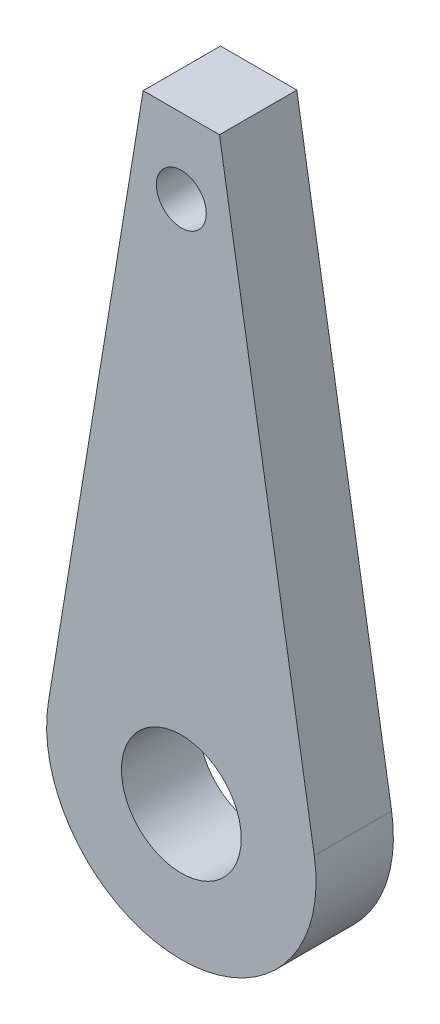
ISO-10303-21;
HEADER;
FILE_DESCRIPTION(('STEP AP214'),'2;1');
FILE_NAME('part.step','',(''),(''),'','','');
FILE_SCHEMA(('AUTOMOTIVE_DESIGN { 1 0 10303 214 1 1 1 1 }'));
ENDSEC;
DATA;
#1=APPLICATION_CONTEXT('core data for automotive mechanical design processes');
#2=APPLICATION_PROTOCOL_DEFINITION('international standard','automotive_design',2000,#1);
#3=PRODUCT_CONTEXT('',#1,'mechanical');
#4=PRODUCT('Part','Part','',(#3));
#5=PRODUCT_RELATED_PRODUCT_CATEGORY('part','',(#4));
#6=PRODUCT_DEFINITION_FORMATION('','',#4);
#7=PRODUCT_DEFINITION_CONTEXT('part definition',#1,'design');
#8=PRODUCT_DEFINITION('design','',#6,#7);
#9=PRODUCT_DEFINITION_SHAPE('','',#8);
#10=(LENGTH_UNIT() NAMED_UNIT(*) SI_UNIT(.MILLI.,.METRE.));
#11=(NAMED_UNIT(*) PLANE_ANGLE_UNIT() SI_UNIT($,.RADIAN.));
#12=(NAMED_UNIT(*) SI_UNIT($,.STERADIAN.) SOLID_ANGLE_UNIT());
#13=UNCERTAINTY_MEASURE_WITH_UNIT(LENGTH_MEASURE(1.E-05),#10,'distance_accuracy_value','');
#14=(GEOMETRIC_REPRESENTATION_CONTEXT(3) GLOBAL_UNCERTAINTY_ASSIGNED_CONTEXT((#13)) GLOBAL_UNIT_ASSIGNED_CONTEXT((#10,
#11,#12)) REPRESENTATION_CONTEXT('',''));
#15=CARTESIAN_POINT('',(0.,0.,0.));
#16=DIRECTION('',(0.,0.,1.));
#17=DIRECTION('',(1.,0.,0.));
#18=AXIS2_PLACEMENT_3D('',#15,#16,#17);
#19=CARTESIAN_POINT('',(-7.36509490352156,-1.20995375006958,3.1));
#20=DIRECTION('',(-0.986772828097113,-0.162109178423755,0.));
#21=DIRECTION('',(0.162109178423755,-0.986772828097113,0.));
#22=AXIS2_PLACEMENT_3D('',#19,#20,#21);
#23=PLANE('',#22);
#24=DIRECTION('',(-0.162109178423755,0.986772828097113,0.));
#25=VECTOR('',#24,1.);
#26=CARTESIAN_POINT('',(-7.36509490352156,-1.20995375006958,0.));
#27=LINE('',#26,#25);
#28=CARTESIAN_POINT('',(-13.7238132981727,37.4961244274482,0.));
#29=VERTEX_POINT('',#28);
#30=CARTESIAN_POINT('',(-17.5227744090712,60.6207348639599,0.));
#31=VERTEX_POINT('',#30);
#32=EDGE_CURVE('E118',#29,#31,#27,.T.);
#33=ORIENTED_EDGE('',*,*,#32,.T.);
#34=DIRECTION('',(0.,0.,-1.));
#35=VECTOR('',#34,1.);
#36=CARTESIAN_POINT('',(-17.5227744090712,60.6207348639599,3.1));
#37=LINE('',#36,#35);
#38=CARTESIAN_POINT('',(-17.5227744090712,60.6207348639599,3.1));
#39=VERTEX_POINT('',#38);
#40=EDGE_CURVE('E13',#39,#31,#37,.T.);
#41=ORIENTED_EDGE('',*,*,#40,.F.);
#42=DIRECTION('',(-0.162109178423755,0.986772828097113,0.));
#43=VECTOR('',#42,1.);
#44=CARTESIAN_POINT('',(-7.36509490352156,-1.20995375006958,3.1));
#45=LINE('',#44,#43);
#46=CARTESIAN_POINT('',(-13.7238132981727,37.4961244274482,3.1));
#47=VERTEX_POINT('',#46);
#48=EDGE_CURVE('E88',#47,#39,#45,.T.);
#49=ORIENTED_EDGE('',*,*,#48,.F.);
#50=DIRECTION('',(0.,0.,-1.));
#51=VECTOR('',#50,1.);
#52=CARTESIAN_POINT('',(-13.7238132981727,37.4961244274482,3.1));
#53=LINE('',#52,#51);
#54=EDGE_CURVE('E114',#47,#29,#53,.T.);
#55=ORIENTED_EDGE('',*,*,#54,.T.);
#56=EDGE_LOOP('',(#33,#41,#49,#55));
#57=FACE_BOUND('',#56,.T.);
#58=ADVANCED_FACE('F48',(#57),#23,.F.);
#59=CARTESIAN_POINT('',(0.,60.6207348639599,3.1));
#60=DIRECTION('',(0.,1.,0.));
#61=DIRECTION('',(0.,0.,1.));
#62=AXIS2_PLACEMENT_3D('',#59,#60,#61);
#63=PLANE('',#62);
#64=DIRECTION('',(1.,0.,0.));
#65=VECTOR('',#64,1.);
#66=CARTESIAN_POINT('',(0.,60.6207348639599,0.));
#67=LINE('',#66,#65);
#68=CARTESIAN_POINT('',(-20.581998730723,60.6207348639599,0.));
#69=VERTEX_POINT('',#68);
#70=EDGE_CURVE('E97',#69,#31,#67,.T.);
#71=ORIENTED_EDGE('',*,*,#70,.F.);
#72=DIRECTION('',(0.,0.,-1.));
#73=VECTOR('',#72,1.);
#74=CARTESIAN_POINT('',(-20.581998730723,60.6207348639599,3.1));
#75=LINE('',#74,#73);
#76=CARTESIAN_POINT('',(-20.581998730723,60.6207348639599,3.1));
#77=VERTEX_POINT('',#76);
#78=EDGE_CURVE('E57',#77,#69,#75,.T.);
#79=ORIENTED_EDGE('',*,*,#78,.F.);
#80=DIRECTION('',(1.,0.,0.));
#81=VECTOR('',#80,1.);
#82=CARTESIAN_POINT('',(0.,60.6207348639599,3.1));
#83=LINE('',#82,#81);
#84=EDGE_CURVE('E95',#77,#39,#83,.T.);
#85=ORIENTED_EDGE('',*,*,#84,.T.);
#86=ORIENTED_EDGE('',*,*,#40,.T.);
#87=EDGE_LOOP('',(#71,#79,#85,#86));
#88=FACE_BOUND('',#87,.T.);
#89=ADVANCED_FACE('F94',(#88),#63,.T.);
#90=CARTESIAN_POINT('',(-29.7383082048074,4.88547371140148,3.1));
#91=DIRECTION('',(-0.986772828097113,0.162109178423755,0.));
#92=DIRECTION('',(-0.162109178423755,-0.986772828097113,0.));
#93=AXIS2_PLACEMENT_3D('',#90,#91,#92);
#94=PLANE('',#93);
#95=DIRECTION('',(0.162109178423755,0.986772828097113,0.));
#96=VECTOR('',#95,1.);
#97=CARTESIAN_POINT('',(-29.7383082048074,4.88547371140148,0.));
#98=LINE('',#97,#96);
#99=CARTESIAN_POINT('',(-24.3809598416215,37.4961244274482,0.));
#100=VERTEX_POINT('',#99);
#101=EDGE_CURVE('E122',#100,#69,#98,.T.);
#102=ORIENTED_EDGE('',*,*,#101,.F.);
#103=DIRECTION('',(0.,0.,-1.));
#104=VECTOR('',#103,1.);
#105=CARTESIAN_POINT('',(-24.3809598416215,37.4961244274482,3.1));
#106=LINE('',#105,#104);
#107=CARTESIAN_POINT('',(-24.3809598416215,37.4961244274482,3.1));
#108=VERTEX_POINT('',#107);
#109=EDGE_CURVE('E80',#108,#100,#106,.T.);
#110=ORIENTED_EDGE('',*,*,#109,.F.);
#111=DIRECTION('',(0.162109178423755,0.986772828097113,0.));
#112=VECTOR('',#111,1.);
#113=CARTESIAN_POINT('',(-29.7383082048074,4.88547371140148,3.1));
#114=LINE('',#113,#112);
#115=EDGE_CURVE('E104',#108,#77,#114,.T.);
#116=ORIENTED_EDGE('',*,*,#115,.T.);
#117=ORIENTED_EDGE('',*,*,#78,.T.);
#118=EDGE_LOOP('',(#102,#110,#116,#117));
#119=FACE_BOUND('',#118,.T.);
#120=ADVANCED_FACE('F106',(#119),#94,.T.);
#121=CARTESIAN_POINT('',(-19.0523865698971,36.6207348639599,3.1));
#122=DIRECTION('',(0.,0.,-1.));
#123=DIRECTION('',(-1.,0.,0.));
#124=AXIS2_PLACEMENT_3D('',#121,#122,#123);
#125=CYLINDRICAL_SURFACE('',#124,5.4);
#126=CARTESIAN_POINT('',(-19.0523865698971,36.6207348639599,0.));
#127=DIRECTION('',(0.,0.,1.));
#128=DIRECTION('',(1.,0.,0.));
#129=AXIS2_PLACEMENT_3D('',#126,#127,#128);
#130=CIRCLE('',#129,5.4);
#131=EDGE_CURVE('E83',#100,#29,#130,.T.);
#132=ORIENTED_EDGE('',*,*,#131,.T.);
#133=ORIENTED_EDGE('',*,*,#54,.F.);
#134=CARTESIAN_POINT('',(-19.0523865698971,36.6207348639599,3.1));
#135=DIRECTION('',(0.,0.,1.));
#136=DIRECTION('',(1.,0.,0.));
#137=AXIS2_PLACEMENT_3D('',#134,#135,#136);
#138=CIRCLE('',#137,5.4);
#139=EDGE_CURVE('E65',#108,#47,#138,.T.);
#140=ORIENTED_EDGE('',*,*,#139,.F.);
#141=ORIENTED_EDGE('',*,*,#109,.T.);
#142=EDGE_LOOP('',(#132,#133,#140,#141));
#143=FACE_BOUND('',#142,.T.);
#144=ADVANCED_FACE('F150',(#143),#125,.T.);
#145=CARTESIAN_POINT('',(-19.0523865698971,57.6207348639599,3.1));
#146=DIRECTION('',(0.,0.,-1.));
#147=DIRECTION('',(-1.,0.,0.));
#148=AXIS2_PLACEMENT_3D('',#145,#146,#147);
#149=CYLINDRICAL_SURFACE('',#148,1.);
#150=CARTESIAN_POINT('',(-19.0523865698971,57.6207348639599,3.1));
#151=DIRECTION('',(0.,0.,1.));
#152=DIRECTION('',(1.,0.,0.));
#153=AXIS2_PLACEMENT_3D('',#150,#151,#152);
#154=CIRCLE('',#153,1.);
#155=CARTESIAN_POINT('',(-18.0523865698971,57.6207348639599,3.1));
#156=VERTEX_POINT('',#155);
#157=EDGE_CURVE('E128',#156,#156,#154,.T.);
#158=ORIENTED_EDGE('',*,*,#157,.T.);
#159=EDGE_LOOP('',(#158));
#160=FACE_BOUND('',#159,.T.);
#161=CARTESIAN_POINT('',(-19.0523865698971,57.6207348639599,0.));
#162=DIRECTION('',(0.,0.,1.));
#163=DIRECTION('',(1.,0.,0.));
#164=AXIS2_PLACEMENT_3D('',#161,#162,#163);
#165=CIRCLE('',#164,1.);
#166=CARTESIAN_POINT('',(-18.0523865698971,57.6207348639599,0.));
#167=VERTEX_POINT('',#166);
#168=EDGE_CURVE('E115',#167,#167,#165,.T.);
#169=ORIENTED_EDGE('',*,*,#168,.F.);
#170=EDGE_LOOP('',(#169));
#171=FACE_BOUND('',#170,.T.);
#172=ADVANCED_FACE('F50',(#160,#171),#149,.F.);
#173=CARTESIAN_POINT('',(-19.0523865698971,36.6207348639599,3.1));
#174=DIRECTION('',(0.,0.,-1.));
#175=DIRECTION('',(-1.,0.,0.));
#176=AXIS2_PLACEMENT_3D('',#173,#174,#175);
#177=CYLINDRICAL_SURFACE('',#176,2.4);
#178=CARTESIAN_POINT('',(-19.0523865698971,36.6207348639599,3.1));
#179=DIRECTION('',(0.,0.,1.));
#180=DIRECTION('',(1.,0.,0.));
#181=AXIS2_PLACEMENT_3D('',#178,#179,#180);
#182=CIRCLE('',#181,2.4);
#183=CARTESIAN_POINT('',(-16.6523865698971,36.6207348639599,3.1));
#184=VERTEX_POINT('',#183);
#185=EDGE_CURVE('E108',#184,#184,#182,.T.);
#186=ORIENTED_EDGE('',*,*,#185,.T.);
#187=EDGE_LOOP('',(#186));
#188=FACE_BOUND('',#187,.T.);
#189=CARTESIAN_POINT('',(-19.0523865698971,36.6207348639599,0.));
#190=DIRECTION('',(0.,0.,1.));
#191=DIRECTION('',(1.,0.,0.));
#192=AXIS2_PLACEMENT_3D('',#189,#190,#191);
#193=CIRCLE('',#192,2.4);
#194=CARTESIAN_POINT('',(-16.6523865698971,36.6207348639599,0.));
#195=VERTEX_POINT('',#194);
#196=EDGE_CURVE('E125',#195,#195,#193,.T.);
#197=ORIENTED_EDGE('',*,*,#196,.F.);
#198=EDGE_LOOP('',(#197));
#199=FACE_BOUND('',#198,.T.);
#200=ADVANCED_FACE('F140',(#188,#199),#177,.F.);
#201=CARTESIAN_POINT('',(0.,0.,3.1));
#202=DIRECTION('',(0.,0.,1.));
#203=DIRECTION('',(1.,0.,0.));
#204=AXIS2_PLACEMENT_3D('',#201,#202,#203);
#205=PLANE('',#204);
#206=ORIENTED_EDGE('',*,*,#157,.F.);
#207=EDGE_LOOP('',(#206));
#208=FACE_BOUND('',#207,.T.);
#209=ORIENTED_EDGE('',*,*,#48,.T.);
#210=ORIENTED_EDGE('',*,*,#84,.F.);
#211=ORIENTED_EDGE('',*,*,#115,.F.);
#212=ORIENTED_EDGE('',*,*,#139,.T.);
#213=EDGE_LOOP('',(#209,#210,#211,#212));
#214=FACE_BOUND('',#213,.T.);
#215=ORIENTED_EDGE('',*,*,#185,.F.);
#216=EDGE_LOOP('',(#215));
#217=FACE_BOUND('',#216,.T.);
#218=ADVANCED_FACE('F102',(#208,#214,#217),#205,.T.);
#219=CARTESIAN_POINT('',(0.,0.,0.));
#220=DIRECTION('',(0.,0.,1.));
#221=DIRECTION('',(1.,0.,0.));
#222=AXIS2_PLACEMENT_3D('',#219,#220,#221);
#223=PLANE('',#222);
#224=ORIENTED_EDGE('',*,*,#168,.T.);
#225=EDGE_LOOP('',(#224));
#226=FACE_BOUND('',#225,.T.);
#227=ORIENTED_EDGE('',*,*,#32,.F.);
#228=ORIENTED_EDGE('',*,*,#131,.F.);
#229=ORIENTED_EDGE('',*,*,#101,.T.);
#230=ORIENTED_EDGE('',*,*,#70,.T.);
#231=EDGE_LOOP('',(#227,#228,#229,#230));
#232=FACE_BOUND('',#231,.T.);
#233=ORIENTED_EDGE('',*,*,#196,.T.);
#234=EDGE_LOOP('',(#233));
#235=FACE_BOUND('',#234,.T.);
#236=ADVANCED_FACE('F133',(#226,#232,#235),#223,.F.);
#237=CLOSED_SHELL('',(#58,#89,#120,#144,#172,#200,#218,#236));
#238=MANIFOLD_SOLID_BREP('B2',#237);
#239=ADVANCED_BREP_SHAPE_REPRESENTATION('',(#18,#238),#14);
#240=SHAPE_DEFINITION_REPRESENTATION(#9,#239);
ENDSEC;
END-ISO-10303-21;
